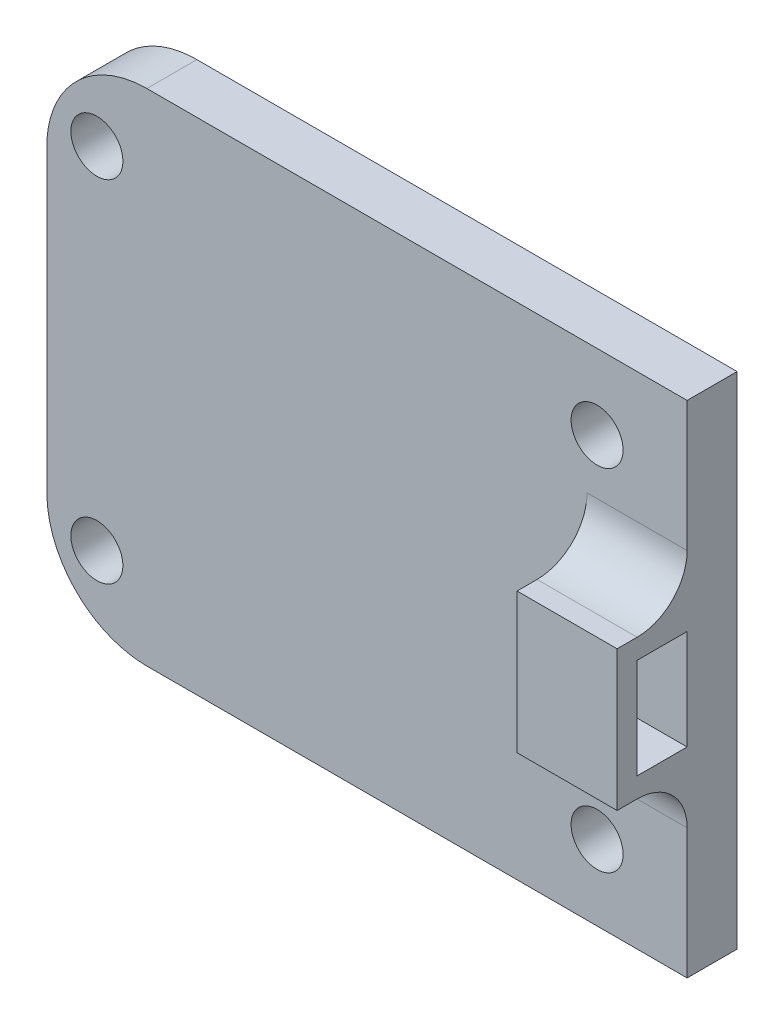
ISO-10303-21;
HEADER;
FILE_DESCRIPTION(('STEP AP214'),'2;1');
FILE_NAME('part.step','',(''),(''),'','','');
FILE_SCHEMA(('AUTOMOTIVE_DESIGN { 1 0 10303 214 1 1 1 1 }'));
ENDSEC;
DATA;
#1=APPLICATION_CONTEXT('core data for automotive mechanical design processes');
#2=APPLICATION_PROTOCOL_DEFINITION('international standard','automotive_design',2000,#1);
#3=PRODUCT_CONTEXT('',#1,'mechanical');
#4=PRODUCT('Part','Part','',(#3));
#5=PRODUCT_RELATED_PRODUCT_CATEGORY('part','',(#4));
#6=PRODUCT_DEFINITION_FORMATION('','',#4);
#7=PRODUCT_DEFINITION_CONTEXT('part definition',#1,'design');
#8=PRODUCT_DEFINITION('design','',#6,#7);
#9=PRODUCT_DEFINITION_SHAPE('','',#8);
#10=(LENGTH_UNIT() NAMED_UNIT(*) SI_UNIT(.MILLI.,.METRE.));
#11=(NAMED_UNIT(*) PLANE_ANGLE_UNIT() SI_UNIT($,.RADIAN.));
#12=(NAMED_UNIT(*) SI_UNIT($,.STERADIAN.) SOLID_ANGLE_UNIT());
#13=UNCERTAINTY_MEASURE_WITH_UNIT(LENGTH_MEASURE(1.E-05),#10,'distance_accuracy_value','');
#14=(GEOMETRIC_REPRESENTATION_CONTEXT(3) GLOBAL_UNCERTAINTY_ASSIGNED_CONTEXT((#13)) GLOBAL_UNIT_ASSIGNED_CONTEXT((#10,
#11,#12)) REPRESENTATION_CONTEXT('',''));
#15=CARTESIAN_POINT('',(0.,0.,0.));
#16=DIRECTION('',(0.,0.,1.));
#17=DIRECTION('',(1.,0.,0.));
#18=AXIS2_PLACEMENT_3D('',#15,#16,#17);
#19=CARTESIAN_POINT('',(0.,0.,5.));
#20=DIRECTION('',(0.,0.,-1.));
#21=DIRECTION('',(-1.,0.,0.));
#22=AXIS2_PLACEMENT_3D('',#19,#20,#21);
#23=PLANE('',#22);
#24=DIRECTION('',(0.,1.,0.));
#25=VECTOR('',#24,1.);
#26=CARTESIAN_POINT('',(54.,30.,5.));
#27=LINE('',#26,#25);
#28=CARTESIAN_POINT('',(54.,30.,5.));
#29=VERTEX_POINT('',#28);
#30=CARTESIAN_POINT('',(54.,37.,5.00000000000001));
#31=VERTEX_POINT('',#30);
#32=EDGE_CURVE('E171',#29,#31,#27,.T.);
#33=ORIENTED_EDGE('',*,*,#32,.T.);
#34=DIRECTION('',(1.,0.,0.));
#35=VECTOR('',#34,1.);
#36=CARTESIAN_POINT('',(0.,37.,5.));
#37=LINE('',#36,#35);
#38=CARTESIAN_POINT('',(64.,37.,5.));
#39=VERTEX_POINT('',#38);
#40=EDGE_CURVE('E457',#31,#39,#37,.T.);
#41=ORIENTED_EDGE('',*,*,#40,.T.);
#42=DIRECTION('',(0.,1.,0.));
#43=VECTOR('',#42,1.);
#44=CARTESIAN_POINT('',(64.,0.,5.));
#45=LINE('',#44,#43);
#46=CARTESIAN_POINT('',(64.,50.,5.));
#47=VERTEX_POINT('',#46);
#48=EDGE_CURVE('E283',#39,#47,#45,.T.);
#49=ORIENTED_EDGE('',*,*,#48,.T.);
#50=DIRECTION('',(-1.,0.,0.));
#51=VECTOR('',#50,1.);
#52=CARTESIAN_POINT('',(0.,50.,5.));
#53=LINE('',#52,#51);
#54=CARTESIAN_POINT('',(10.,50.,5.));
#55=VERTEX_POINT('',#54);
#56=EDGE_CURVE('E288',#47,#55,#53,.T.);
#57=ORIENTED_EDGE('',*,*,#56,.T.);
#58=CARTESIAN_POINT('',(10.,50.,5.));
#59=CARTESIAN_POINT('',(9.71873940862939,50.0000302437821,5.));
#60=CARTESIAN_POINT('',(9.43748316088036,49.9881351412365,5.));
#61=CARTESIAN_POINT('',(8.87698298794853,49.9407126842738,5.));
#62=CARTESIAN_POINT('',(8.59773896688503,49.9051864634849,5.));
#63=CARTESIAN_POINT('',(8.04344901235633,49.8107558621721,5.));
#64=CARTESIAN_POINT('',(7.76840006617864,49.7518691668823,5.));
#65=CARTESIAN_POINT('',(7.22424096829988,49.6111459958114,5.));
#66=CARTESIAN_POINT('',(6.95513074414697,49.529309800179,5.));
#67=CARTESIAN_POINT('',(6.42463096564197,49.3432216940755,5.));
#68=CARTESIAN_POINT('',(6.16324515458578,49.2389591118716,5.));
#69=CARTESIAN_POINT('',(5.65018139195263,49.0087808876758,5.));
#70=CARTESIAN_POINT('',(5.39850364584242,48.8828647877046,5.));
#71=CARTESIAN_POINT('',(4.90669683616817,48.610301372502,5.));
#72=CARTESIAN_POINT('',(4.66656565305335,48.4636578817249,5.));
#73=CARTESIAN_POINT('',(4.19951051282324,48.1506654585722,5.));
#74=CARTESIAN_POINT('',(3.97258648456532,47.9843166323574,5.));
#75=CARTESIAN_POINT('',(3.53355882321716,47.6330965634878,5.));
#76=CARTESIAN_POINT('',(3.32145508500275,47.4482254522391,5.));
#77=CARTESIAN_POINT('',(2.91357387490113,47.0612739280054,5.));
#78=CARTESIAN_POINT('',(2.71779640338468,46.8591935146296,5.));
#79=CARTESIAN_POINT('',(2.34392120071282,46.4392168814837,5.));
#80=CARTESIAN_POINT('',(2.16582707835699,46.2213174490276,5.));
#81=CARTESIAN_POINT('',(1.8286329512801,45.7712923694028,5.));
#82=CARTESIAN_POINT('',(1.66953265427646,45.5391669412312,4.99999999999999));
#83=CARTESIAN_POINT('',(1.37142258831917,45.0622858327539,4.99999999999999));
#84=CARTESIAN_POINT('',(1.23241708546066,44.8175274854213,5.));
#85=CARTESIAN_POINT('',(0.975528047911703,44.3171746784549,5.));
#86=CARTESIAN_POINT('',(0.857644161593804,44.0615803993028,5.00000000000001));
#87=CARTESIAN_POINT('',(0.643882115547591,43.5414762201447,4.99999999999999));
#88=CARTESIAN_POINT('',(0.54799387625296,43.2769704678346,4.99999999999998));
#89=CARTESIAN_POINT('',(0.378859660093142,42.7409265033633,5.00000000000002));
#90=CARTESIAN_POINT('',(0.305608240388747,42.4693899987335,5.00000000000007));
#91=CARTESIAN_POINT('',(0.162897478890375,41.8350735853804,5.00000000000008));
#92=CARTESIAN_POINT('',(0.101812944811614,41.4703549279125,5.00000000000002));
#93=CARTESIAN_POINT('',(0.040732368577235,40.9203488802216,4.99999999999999));
#94=CARTESIAN_POINT('',(0.025463227479286,40.7366189268432,5.));
#95=CARTESIAN_POINT('',(0.00509827072727374,40.368607713583,5.));
#96=CARTESIAN_POINT('',(1.80814562152659E-06,40.1843264895054,5.));
#97=CARTESIAN_POINT('',(0.,40.,4.99999999999998));
#98=B_SPLINE_CURVE_WITH_KNOTS('',3,(#58,#59,#60,#61,#62,#63,#64,#65,#66,#67,#68,#69,#70,#71,#72,
#73,#74,#75,#76,#77,#78,#79,#80,#81,#82,#83,#84,#85,#86,#87,#88,#89,#90,#91,#92,#93,#94,#95,#96,
#97),.UNSPECIFIED.,.F.,.F.,(4,2,2,2,2,2,2,2,2,2,2,2,2,2,2,2,2,2,2,4),(0.,0.843524225534215,
1.68700798857624,2.52985440039549,3.37269052387661,4.2159286068662,5.05918452682157,
5.90228505847176,6.74538104819433,7.58847105701002,8.43156108497183,9.27482281775598,
10.1180715725067,10.9614990856436,11.804912556303,12.6479387548297,13.4907620965667,
14.5975846256286,15.1504384772059,15.7032571691341),.UNSPECIFIED.);
#99=CARTESIAN_POINT('',(0.,40.,5.));
#100=VERTEX_POINT('',#99);
#101=EDGE_CURVE('E396',#55,#100,#98,.T.);
#102=ORIENTED_EDGE('',*,*,#101,.T.);
#103=DIRECTION('',(0.,-1.,0.));
#104=VECTOR('',#103,1.);
#105=CARTESIAN_POINT('',(0.,0.,5.));
#106=LINE('',#105,#104);
#107=CARTESIAN_POINT('',(0.,10.,5.));
#108=VERTEX_POINT('',#107);
#109=EDGE_CURVE('E275',#100,#108,#106,.T.);
#110=ORIENTED_EDGE('',*,*,#109,.T.);
#111=CARTESIAN_POINT('',(0.,10.,5.));
#112=CARTESIAN_POINT('',(-3.02437820508573E-05,9.71873940862939,5.));
#113=CARTESIAN_POINT('',(0.0118648587635351,9.43748316088036,5.));
#114=CARTESIAN_POINT('',(0.0592873157262324,8.87698298794852,5.));
#115=CARTESIAN_POINT('',(0.0948135365150906,8.59773896688503,5.));
#116=CARTESIAN_POINT('',(0.189244137827918,8.04344901235632,5.));
#117=CARTESIAN_POINT('',(0.248130833117677,7.76840006617864,5.));
#118=CARTESIAN_POINT('',(0.388854004188663,7.22424096829988,5.));
#119=CARTESIAN_POINT('',(0.470690199820989,6.95513074414697,5.));
#120=CARTESIAN_POINT('',(0.656778305924568,6.42463096564197,5.));
#121=CARTESIAN_POINT('',(0.76104088812843,6.16324515458577,5.));
#122=CARTESIAN_POINT('',(0.991219112324222,5.65018139195262,5.));
#123=CARTESIAN_POINT('',(1.11713521229541,5.39850364584242,5.));
#124=CARTESIAN_POINT('',(1.38969862749806,4.90669683616817,5.));
#125=CARTESIAN_POINT('',(1.53634211827508,4.66656565305335,5.));
#126=CARTESIAN_POINT('',(1.8493345414278,4.19951051282324,5.));
#127=CARTESIAN_POINT('',(2.01568336764263,3.97258648456532,5.00000000000001));
#128=CARTESIAN_POINT('',(2.36690343651221,3.53355882321717,5.00000000000001));
#129=CARTESIAN_POINT('',(2.55177454776092,3.32145508500274,5.));
#130=CARTESIAN_POINT('',(2.93872607199461,2.91357387490112,5.));
#131=CARTESIAN_POINT('',(3.14080648537042,2.71779640338468,5.));
#132=CARTESIAN_POINT('',(3.5607831185163,2.34392120071282,5.));
#133=CARTESIAN_POINT('',(3.77868255097239,2.16582707835699,5.));
#134=CARTESIAN_POINT('',(4.22870763059718,1.8286329512801,5.));
#135=CARTESIAN_POINT('',(4.46083305876885,1.66953265427646,5.));
#136=CARTESIAN_POINT('',(4.93771416724614,1.37142258831917,5.));
#137=CARTESIAN_POINT('',(5.18247251457876,1.23241708546066,5.));
#138=CARTESIAN_POINT('',(5.68282532154507,0.975528047911706,5.));
#139=CARTESIAN_POINT('',(5.93841960069723,0.857644161593809,5.));
#140=CARTESIAN_POINT('',(6.4585237798553,0.643882115547596,5.));
#141=CARTESIAN_POINT('',(6.72302953216546,0.547993876252964,5.));
#142=CARTESIAN_POINT('',(7.25907349663673,0.378859660093146,5.));
#143=CARTESIAN_POINT('',(7.53061000126654,0.30560824038875,5.));
#144=CARTESIAN_POINT('',(8.16492641461962,0.162897478890377,5.));
#145=CARTESIAN_POINT('',(8.5296450720875,0.101812944811615,5.));
#146=CARTESIAN_POINT('',(9.07965111977843,0.0407323685772355,5.));
#147=CARTESIAN_POINT('',(9.26338107315682,0.0254632274792861,5.));
#148=CARTESIAN_POINT('',(9.63139228641706,0.00509827072727316,5.));
#149=CARTESIAN_POINT('',(9.81567351049458,1.8081456208478E-06,5.));
#150=CARTESIAN_POINT('',(10.,0.,5.));
#151=B_SPLINE_CURVE_WITH_KNOTS('',3,(#111,#112,#113,#114,#115,#116,#117,#118,#119,#120,#121,
#122,#123,#124,#125,#126,#127,#128,#129,#130,#131,#132,#133,#134,#135,#136,#137,#138,#139,#140,
#141,#142,#143,#144,#145,#146,#147,#148,#149,#150),.UNSPECIFIED.,.F.,.F.,(4,2,2,2,2,2,2,2,2,2,2,
2,2,2,2,2,2,2,2,4),(0.,0.843524225534219,1.68700798857625,2.52985440039549,3.37269052387661,
4.2159286068662,5.05918452682158,5.90228505847177,6.74538104819434,7.58847105701003,
8.43156108497184,9.27482281775598,10.1180715725067,10.9614990856436,11.804912556303,
12.6479387548297,13.4907620965666,14.5975846256286,15.1504384772059,15.7032571691341),.UNSPECIFIED.);
#152=CARTESIAN_POINT('',(10.,0.,5.));
#153=VERTEX_POINT('',#152);
#154=EDGE_CURVE('E376',#108,#153,#151,.T.);
#155=ORIENTED_EDGE('',*,*,#154,.T.);
#156=DIRECTION('',(1.,0.,0.));
#157=VECTOR('',#156,1.);
#158=CARTESIAN_POINT('',(0.,0.,5.));
#159=LINE('',#158,#157);
#160=CARTESIAN_POINT('',(64.,0.,5.));
#161=VERTEX_POINT('',#160);
#162=EDGE_CURVE('E279',#153,#161,#159,.T.);
#163=ORIENTED_EDGE('',*,*,#162,.T.);
#164=CARTESIAN_POINT('',(64.,13.,5.));
#165=VERTEX_POINT('',#164);
#166=EDGE_CURVE('E284',#161,#165,#45,.T.);
#167=ORIENTED_EDGE('',*,*,#166,.T.);
#168=DIRECTION('',(1.,0.,0.));
#169=VECTOR('',#168,1.);
#170=CARTESIAN_POINT('',(0.,13.,5.));
#171=LINE('',#170,#169);
#172=CARTESIAN_POINT('',(54.,13.,5.));
#173=VERTEX_POINT('',#172);
#174=EDGE_CURVE('E472',#165,#173,#171,.F.);
#175=ORIENTED_EDGE('',*,*,#174,.T.);
#176=DIRECTION('',(0.,1.,0.));
#177=VECTOR('',#176,1.);
#178=CARTESIAN_POINT('',(54.,18.,5.));
#179=LINE('',#178,#177);
#180=CARTESIAN_POINT('',(54.,20.,5.));
#181=VERTEX_POINT('',#180);
#182=EDGE_CURVE('E188',#173,#181,#179,.T.);
#183=ORIENTED_EDGE('',*,*,#182,.T.);
#184=DIRECTION('',(1.,0.,0.));
#185=VECTOR('',#184,1.);
#186=CARTESIAN_POINT('',(54.,20.,5.));
#187=LINE('',#186,#185);
#188=CARTESIAN_POINT('',(64.,20.,5.));
#189=VERTEX_POINT('',#188);
#190=EDGE_CURVE('E237',#181,#189,#187,.T.);
#191=ORIENTED_EDGE('',*,*,#190,.T.);
#192=CARTESIAN_POINT('',(64.,30.,5.));
#193=VERTEX_POINT('',#192);
#194=EDGE_CURVE('E289',#189,#193,#45,.T.);
#195=ORIENTED_EDGE('',*,*,#194,.T.);
#196=DIRECTION('',(1.,0.,0.));
#197=VECTOR('',#196,1.);
#198=CARTESIAN_POINT('',(54.,30.,5.));
#199=LINE('',#198,#197);
#200=EDGE_CURVE('E226',#29,#193,#199,.T.);
#201=ORIENTED_EDGE('',*,*,#200,.F.);
#202=EDGE_LOOP('',(#33,#41,#49,#57,#102,#110,#155,#163,#167,#175,#183,#191,#195,#201));
#203=FACE_BOUND('',#202,.T.);
#204=CARTESIAN_POINT('',(5.,42.5,5.));
#205=DIRECTION('',(0.,0.,1.));
#206=DIRECTION('',(1.,0.,0.));
#207=AXIS2_PLACEMENT_3D('',#204,#205,#206);
#208=CIRCLE('',#207,2.6);
#209=CARTESIAN_POINT('',(7.6,42.5,5.));
#210=VERTEX_POINT('',#209);
#211=EDGE_CURVE('E267',#210,#210,#208,.T.);
#212=ORIENTED_EDGE('',*,*,#211,.F.);
#213=EDGE_LOOP('',(#212));
#214=FACE_BOUND('',#213,.T.);
#215=CARTESIAN_POINT('',(55.,42.5,5.));
#216=DIRECTION('',(0.,0.,1.));
#217=DIRECTION('',(1.,0.,0.));
#218=AXIS2_PLACEMENT_3D('',#215,#216,#217);
#219=CIRCLE('',#218,2.6);
#220=CARTESIAN_POINT('',(57.6,42.5,5.));
#221=VERTEX_POINT('',#220);
#222=EDGE_CURVE('E259',#221,#221,#219,.T.);
#223=ORIENTED_EDGE('',*,*,#222,.F.);
#224=EDGE_LOOP('',(#223));
#225=FACE_BOUND('',#224,.T.);
#226=CARTESIAN_POINT('',(55.0000000000004,7.5,5.));
#227=DIRECTION('',(0.,0.,1.));
#228=DIRECTION('',(1.,0.,0.));
#229=AXIS2_PLACEMENT_3D('',#226,#227,#228);
#230=CIRCLE('',#229,2.6);
#231=CARTESIAN_POINT('',(57.6000000000004,7.5,5.));
#232=VERTEX_POINT('',#231);
#233=EDGE_CURVE('E251',#232,#232,#230,.T.);
#234=ORIENTED_EDGE('',*,*,#233,.F.);
#235=EDGE_LOOP('',(#234));
#236=FACE_BOUND('',#235,.T.);
#237=CARTESIAN_POINT('',(5.00000000000036,7.5,5.));
#238=DIRECTION('',(0.,0.,1.));
#239=DIRECTION('',(1.,0.,0.));
#240=AXIS2_PLACEMENT_3D('',#237,#238,#239);
#241=CIRCLE('',#240,2.6);
#242=CARTESIAN_POINT('',(7.60000000000036,7.5,5.));
#243=VERTEX_POINT('',#242);
#244=EDGE_CURVE('E243',#243,#243,#241,.T.);
#245=ORIENTED_EDGE('',*,*,#244,.F.);
#246=EDGE_LOOP('',(#245));
#247=FACE_BOUND('',#246,.T.);
#248=ADVANCED_FACE('F45',(#203,#214,#225,#236,#247),#23,.F.);
#249=CARTESIAN_POINT('',(0.,0.,0.));
#250=DIRECTION('',(0.,0.,-1.));
#251=DIRECTION('',(-1.,0.,0.));
#252=AXIS2_PLACEMENT_3D('',#249,#250,#251);
#253=PLANE('',#252);
#254=CARTESIAN_POINT('',(55.0000000000004,7.5,0.));
#255=DIRECTION('',(0.,0.,1.));
#256=DIRECTION('',(1.,0.,0.));
#257=AXIS2_PLACEMENT_3D('',#254,#255,#256);
#258=CIRCLE('',#257,2.6);
#259=CARTESIAN_POINT('',(57.6000000000004,7.5,0.));
#260=VERTEX_POINT('',#259);
#261=EDGE_CURVE('E247',#260,#260,#258,.T.);
#262=ORIENTED_EDGE('',*,*,#261,.T.);
#263=EDGE_LOOP('',(#262));
#264=FACE_BOUND('',#263,.T.);
#265=CARTESIAN_POINT('',(5.,42.5,0.));
#266=DIRECTION('',(0.,0.,1.));
#267=DIRECTION('',(1.,0.,0.));
#268=AXIS2_PLACEMENT_3D('',#265,#266,#267);
#269=CIRCLE('',#268,2.6);
#270=CARTESIAN_POINT('',(7.6,42.5,0.));
#271=VERTEX_POINT('',#270);
#272=EDGE_CURVE('E263',#271,#271,#269,.T.);
#273=ORIENTED_EDGE('',*,*,#272,.T.);
#274=EDGE_LOOP('',(#273));
#275=FACE_BOUND('',#274,.T.);
#276=DIRECTION('',(0.,-1.,0.));
#277=VECTOR('',#276,1.);
#278=CARTESIAN_POINT('',(0.,0.,0.));
#279=LINE('',#278,#277);
#280=CARTESIAN_POINT('',(0.,40.,0.));
#281=VERTEX_POINT('',#280);
#282=CARTESIAN_POINT('',(0.,10.,0.));
#283=VERTEX_POINT('',#282);
#284=EDGE_CURVE('E271',#281,#283,#279,.T.);
#285=ORIENTED_EDGE('',*,*,#284,.F.);
#286=CARTESIAN_POINT('',(0.,40.,0.));
#287=CARTESIAN_POINT('',(-3.02437820511849E-05,40.2812605913706,0.));
#288=CARTESIAN_POINT('',(0.011864858763535,40.5625168391197,0.));
#289=CARTESIAN_POINT('',(0.0592873157262323,41.1230170120515,0.));
#290=CARTESIAN_POINT('',(0.0948135365150903,41.402261033115,0.));
#291=CARTESIAN_POINT('',(0.189244137827916,41.9565509876437,0.));
#292=CARTESIAN_POINT('',(0.248130833117673,42.2315999338214,0.));
#293=CARTESIAN_POINT('',(0.388854004188659,42.7757590317001,0.));
#294=CARTESIAN_POINT('',(0.470690199820987,43.044869255853,0.));
#295=CARTESIAN_POINT('',(0.656778305924568,43.575369034358,0.));
#296=CARTESIAN_POINT('',(0.761040888128432,43.8367548454142,0.));
#297=CARTESIAN_POINT('',(0.991219112324221,44.3498186080474,0.));
#298=CARTESIAN_POINT('',(1.1171352122954,44.6014963541576,0.));
#299=CARTESIAN_POINT('',(1.38969862749805,45.0933031638318,0.));
#300=CARTESIAN_POINT('',(1.53634211827508,45.3334343469467,0.));
#301=CARTESIAN_POINT('',(1.8493345414278,45.8004894871768,0.));
#302=CARTESIAN_POINT('',(2.01568336764263,46.0274135154347,0.));
#303=CARTESIAN_POINT('',(2.3669034365122,46.4664411767828,0.));
#304=CARTESIAN_POINT('',(2.55177454776091,46.6785449149973,0.));
#305=CARTESIAN_POINT('',(2.9387260719946,47.0864261250989,0.));
#306=CARTESIAN_POINT('',(3.14080648537041,47.2822035966153,0.));
#307=CARTESIAN_POINT('',(3.56078311851629,47.6560787992872,0.));
#308=CARTESIAN_POINT('',(3.77868255097239,47.834172921643,0.));
#309=CARTESIAN_POINT('',(4.22870763059718,48.1713670487199,0.));
#310=CARTESIAN_POINT('',(4.46083305876884,48.3304673457236,0.));
#311=CARTESIAN_POINT('',(4.93771416724614,48.6285774116808,0.));
#312=CARTESIAN_POINT('',(5.18247251457876,48.7675829145394,0.));
#313=CARTESIAN_POINT('',(5.68282532154507,49.0244719520883,0.));
#314=CARTESIAN_POINT('',(5.93841960069722,49.1423558384062,0.));
#315=CARTESIAN_POINT('',(6.45852377985529,49.3561178844524,0.));
#316=CARTESIAN_POINT('',(6.72302953216546,49.4520061237471,0.));
#317=CARTESIAN_POINT('',(7.25907349663673,49.6211403399069,0.));
#318=CARTESIAN_POINT('',(7.53061000126654,49.6943917596113,0.));
#319=CARTESIAN_POINT('',(8.16492641461962,49.8371025211096,0.));
#320=CARTESIAN_POINT('',(8.5296450720875,49.8981870551884,0.));
#321=CARTESIAN_POINT('',(9.07965111977843,49.9592676314228,0.));
#322=CARTESIAN_POINT('',(9.26338107315682,49.9745367725207,0.));
#323=CARTESIAN_POINT('',(9.63139228641706,49.9949017292727,0.));
#324=CARTESIAN_POINT('',(9.81567351049458,49.9999981918544,0.));
#325=CARTESIAN_POINT('',(10.,50.,0.));
#326=B_SPLINE_CURVE_WITH_KNOTS('',3,(#286,#287,#288,#289,#290,#291,#292,#293,#294,#295,#296,
#297,#298,#299,#300,#301,#302,#303,#304,#305,#306,#307,#308,#309,#310,#311,#312,#313,#314,#315,
#316,#317,#318,#319,#320,#321,#322,#323,#324,#325),.UNSPECIFIED.,.F.,.F.,(4,2,2,2,2,2,2,2,2,2,2,
2,2,2,2,2,2,2,2,4),(0.,0.843524225534214,1.68700798857624,2.52985440039549,3.37269052387661,
4.21592860686619,5.05918452682157,5.90228505847176,6.74538104819433,7.58847105701002,
8.43156108497182,9.27482281775597,10.1180715725067,10.9614990856436,11.804912556303,
12.6479387548297,13.4907620965666,14.5975846256286,15.1504384772058,15.7032571691341),.UNSPECIFIED.);
#327=CARTESIAN_POINT('',(10.,50.,0.));
#328=VERTEX_POINT('',#327);
#329=EDGE_CURVE('E338',#281,#328,#326,.T.);
#330=ORIENTED_EDGE('',*,*,#329,.T.);
#331=DIRECTION('',(-1.,0.,0.));
#332=VECTOR('',#331,1.);
#333=CARTESIAN_POINT('',(0.,50.,0.));
#334=LINE('',#333,#332);
#335=CARTESIAN_POINT('',(64.,50.,0.));
#336=VERTEX_POINT('',#335);
#337=EDGE_CURVE('E280',#336,#328,#334,.T.);
#338=ORIENTED_EDGE('',*,*,#337,.F.);
#339=DIRECTION('',(0.,1.,0.));
#340=VECTOR('',#339,1.);
#341=CARTESIAN_POINT('',(64.,0.,0.));
#342=LINE('',#341,#340);
#343=CARTESIAN_POINT('',(64.,0.,0.));
#344=VERTEX_POINT('',#343);
#345=EDGE_CURVE('E300',#344,#336,#342,.T.);
#346=ORIENTED_EDGE('',*,*,#345,.F.);
#347=DIRECTION('',(1.,0.,0.));
#348=VECTOR('',#347,1.);
#349=CARTESIAN_POINT('',(0.,0.,0.));
#350=LINE('',#349,#348);
#351=CARTESIAN_POINT('',(10.,0.,0.));
#352=VERTEX_POINT('',#351);
#353=EDGE_CURVE('E297',#352,#344,#350,.T.);
#354=ORIENTED_EDGE('',*,*,#353,.F.);
#355=CARTESIAN_POINT('',(10.,0.,0.));
#356=CARTESIAN_POINT('',(9.71873940862939,-3.02437820508262E-05,0.));
#357=CARTESIAN_POINT('',(9.43748316088036,0.0118648587635351,0.));
#358=CARTESIAN_POINT('',(8.87698298794852,0.0592873157262323,0.));
#359=CARTESIAN_POINT('',(8.59773896688503,0.0948135365150903,0.));
#360=CARTESIAN_POINT('',(8.04344901235632,0.189244137827918,0.));
#361=CARTESIAN_POINT('',(7.76840006617864,0.248130833117677,0.));
#362=CARTESIAN_POINT('',(7.22424096829989,0.388854004188663,0.));
#363=CARTESIAN_POINT('',(6.95513074414697,0.470690199820988,0.));
#364=CARTESIAN_POINT('',(6.42463096564197,0.656778305924566,0.));
#365=CARTESIAN_POINT('',(6.16324515458577,0.761040888128429,0.));
#366=CARTESIAN_POINT('',(5.65018139195263,0.991219112324221,0.));
#367=CARTESIAN_POINT('',(5.39850364584242,1.1171352122954,0.));
#368=CARTESIAN_POINT('',(4.90669683616818,1.38969862749805,0.));
#369=CARTESIAN_POINT('',(4.66656565305335,1.53634211827508,0.));
#370=CARTESIAN_POINT('',(4.19951051282324,1.8493345414278,0.));
#371=CARTESIAN_POINT('',(3.97258648456532,2.01568336764263,0.));
#372=CARTESIAN_POINT('',(3.53355882321717,2.36690343651221,0.));
#373=CARTESIAN_POINT('',(3.32145508500275,2.55177454776091,0.));
#374=CARTESIAN_POINT('',(2.91357387490112,2.93872607199461,0.));
#375=CARTESIAN_POINT('',(2.71779640338468,3.14080648537041,0.));
#376=CARTESIAN_POINT('',(2.34392120071282,3.56078311851629,0.));
#377=CARTESIAN_POINT('',(2.165827078357,3.77868255097239,0.));
#378=CARTESIAN_POINT('',(1.82863295128011,4.22870763059718,0.));
#379=CARTESIAN_POINT('',(1.66953265427646,4.46083305876884,0.));
#380=CARTESIAN_POINT('',(1.37142258831917,4.93771416724613,0.));
#381=CARTESIAN_POINT('',(1.23241708546067,5.18247251457876,0.));
#382=CARTESIAN_POINT('',(0.975528047911709,5.68282532154506,0.));
#383=CARTESIAN_POINT('',(0.857644161593811,5.93841960069722,0.));
#384=CARTESIAN_POINT('',(0.643882115547598,6.45852377985529,0.));
#385=CARTESIAN_POINT('',(0.547993876252966,6.72302953216546,0.));
#386=CARTESIAN_POINT('',(0.378859660093147,7.25907349663673,0.));
#387=CARTESIAN_POINT('',(0.305608240388751,7.53061000126653,0.));
#388=CARTESIAN_POINT('',(0.162897478890378,8.16492641461961,0.));
#389=CARTESIAN_POINT('',(0.101812944811616,8.52964507208749,0.));
#390=CARTESIAN_POINT('',(0.040732368577236,9.07965111977843,0.));
#391=CARTESIAN_POINT('',(0.0254632274792864,9.26338107315682,0.));
#392=CARTESIAN_POINT('',(0.00509827072727319,9.63139228641706,0.));
#393=CARTESIAN_POINT('',(1.80814562080788E-06,9.81567351049458,0.));
#394=CARTESIAN_POINT('',(0.,10.,0.));
#395=B_SPLINE_CURVE_WITH_KNOTS('',3,(#355,#356,#357,#358,#359,#360,#361,#362,#363,#364,#365,
#366,#367,#368,#369,#370,#371,#372,#373,#374,#375,#376,#377,#378,#379,#380,#381,#382,#383,#384,
#385,#386,#387,#388,#389,#390,#391,#392,#393,#394),.UNSPECIFIED.,.F.,.F.,(4,2,2,2,2,2,2,2,2,2,2,
2,2,2,2,2,2,2,2,4),(0.,0.843524225534221,1.68700798857624,2.52985440039549,3.37269052387661,
4.2159286068662,5.05918452682157,5.90228505847176,6.74538104819434,7.58847105701002,
8.43156108497183,9.27482281775598,10.1180715725067,10.9614990856436,11.804912556303,
12.6479387548297,13.4907620965666,14.5975846256286,15.1504384772058,15.7032571691341),.UNSPECIFIED.);
#396=EDGE_CURVE('E327',#352,#283,#395,.T.);
#397=ORIENTED_EDGE('',*,*,#396,.T.);
#398=EDGE_LOOP('',(#285,#330,#338,#346,#354,#397));
#399=FACE_BOUND('',#398,.T.);
#400=CARTESIAN_POINT('',(55.,42.5,0.));
#401=DIRECTION('',(0.,0.,1.));
#402=DIRECTION('',(1.,0.,0.));
#403=AXIS2_PLACEMENT_3D('',#400,#401,#402);
#404=CIRCLE('',#403,2.6);
#405=CARTESIAN_POINT('',(57.6,42.5,0.));
#406=VERTEX_POINT('',#405);
#407=EDGE_CURVE('E255',#406,#406,#404,.T.);
#408=ORIENTED_EDGE('',*,*,#407,.T.);
#409=EDGE_LOOP('',(#408));
#410=FACE_BOUND('',#409,.T.);
#411=CARTESIAN_POINT('',(5.00000000000036,7.5,0.));
#412=DIRECTION('',(0.,0.,1.));
#413=DIRECTION('',(1.,0.,0.));
#414=AXIS2_PLACEMENT_3D('',#411,#412,#413);
#415=CIRCLE('',#414,2.6);
#416=CARTESIAN_POINT('',(7.60000000000036,7.5,0.));
#417=VERTEX_POINT('',#416);
#418=EDGE_CURVE('E230',#417,#417,#415,.T.);
#419=ORIENTED_EDGE('',*,*,#418,.T.);
#420=EDGE_LOOP('',(#419));
#421=FACE_BOUND('',#420,.T.);
#422=ADVANCED_FACE('F345',(#264,#275,#399,#410,#421),#253,.T.);
#423=CARTESIAN_POINT('',(0.,0.,5.));
#424=DIRECTION('',(1.,0.,0.));
#425=DIRECTION('',(0.,0.,-1.));
#426=AXIS2_PLACEMENT_3D('',#423,#424,#425);
#427=PLANE('',#426);
#428=ORIENTED_EDGE('',*,*,#109,.F.);
#429=CARTESIAN_POINT('',(0.,40.,15.));
#430=CARTESIAN_POINT('',(0.,40.,11.6666666666666));
#431=CARTESIAN_POINT('',(0.,40.,8.33333333333332));
#432=CARTESIAN_POINT('',(0.,40.,4.99999999999998));
#433=CARTESIAN_POINT('',(0.,40.,3.33333333333332));
#434=CARTESIAN_POINT('',(0.,40.,1.66666666666665));
#435=CARTESIAN_POINT('',(0.,40.,0.));
#436=CARTESIAN_POINT('',(0.,40.,-3.33333333333335));
#437=CARTESIAN_POINT('',(0.,40.,-6.66666666666669));
#438=CARTESIAN_POINT('',(0.,40.,-10.));
#439=(BOUNDED_CURVE() B_SPLINE_CURVE(3,(#429,#430,#431,#432,#433,#434,#435,#436,#437,#438),
.UNSPECIFIED.,.F.,.F.) B_SPLINE_CURVE_WITH_KNOTS((4,3,3,4),(-0.01,0.,0.005,0.015),
.UNSPECIFIED.) CURVE() GEOMETRIC_REPRESENTATION_ITEM() RATIONAL_B_SPLINE_CURVE((1.,1.,1.,1.,1.,
1.,1.,1.,1.,1.)) REPRESENTATION_ITEM(''));
#440=EDGE_CURVE('E318',#100,#281,#439,.T.);
#441=ORIENTED_EDGE('',*,*,#440,.T.);
#442=ORIENTED_EDGE('',*,*,#284,.T.);
#443=CARTESIAN_POINT('',(0.,10.,15.));
#444=CARTESIAN_POINT('',(0.,10.,11.6666666666667));
#445=CARTESIAN_POINT('',(0.,10.,8.33333333333334));
#446=CARTESIAN_POINT('',(0.,10.,5.));
#447=CARTESIAN_POINT('',(0.,10.,3.33333333333334));
#448=CARTESIAN_POINT('',(0.,10.,1.66666666666667));
#449=CARTESIAN_POINT('',(0.,10.,0.));
#450=CARTESIAN_POINT('',(0.,10.,-3.33333333333333));
#451=CARTESIAN_POINT('',(0.,10.,-6.66666666666666));
#452=CARTESIAN_POINT('',(0.,10.,-10.));
#453=(BOUNDED_CURVE() B_SPLINE_CURVE(3,(#443,#444,#445,#446,#447,#448,#449,#450,#451,#452),
.UNSPECIFIED.,.F.,.F.) B_SPLINE_CURVE_WITH_KNOTS((4,3,3,4),(-0.01,0.,0.005,0.015),
.UNSPECIFIED.) CURVE() GEOMETRIC_REPRESENTATION_ITEM() RATIONAL_B_SPLINE_CURVE((1.,1.,1.,1.,1.,
1.,1.,1.,1.,1.)) REPRESENTATION_ITEM(''));
#454=EDGE_CURVE('E313',#283,#108,#453,.F.);
#455=ORIENTED_EDGE('',*,*,#454,.T.);
#456=EDGE_LOOP('',(#428,#441,#442,#455));
#457=FACE_BOUND('',#456,.T.);
#458=ADVANCED_FACE('F497',(#457),#427,.F.);
#459=CARTESIAN_POINT('',(0.,0.,5.));
#460=DIRECTION('',(0.,1.,0.));
#461=DIRECTION('',(0.,0.,1.));
#462=AXIS2_PLACEMENT_3D('',#459,#460,#461);
#463=PLANE('',#462);
#464=ORIENTED_EDGE('',*,*,#162,.F.);
#465=CARTESIAN_POINT('',(10.,0.,15.));
#466=CARTESIAN_POINT('',(10.,0.,11.6666666666667));
#467=CARTESIAN_POINT('',(10.,0.,8.33333333333334));
#468=CARTESIAN_POINT('',(10.,0.,5.));
#469=CARTESIAN_POINT('',(10.,0.,3.33333333333334));
#470=CARTESIAN_POINT('',(10.,0.,1.66666666666667));
#471=CARTESIAN_POINT('',(10.,0.,0.));
#472=CARTESIAN_POINT('',(10.,0.,-3.33333333333333));
#473=CARTESIAN_POINT('',(10.,0.,-6.66666666666666));
#474=CARTESIAN_POINT('',(10.,0.,-10.));
#475=(BOUNDED_CURVE() B_SPLINE_CURVE(3,(#465,#466,#467,#468,#469,#470,#471,#472,#473,#474),
.UNSPECIFIED.,.F.,.F.) B_SPLINE_CURVE_WITH_KNOTS((4,3,3,4),(-0.01,0.,0.005,0.015),
.UNSPECIFIED.) CURVE() GEOMETRIC_REPRESENTATION_ITEM() RATIONAL_B_SPLINE_CURVE((1.,1.,1.,1.,1.,
1.,1.,1.,1.,1.)) REPRESENTATION_ITEM(''));
#476=EDGE_CURVE('E475',#153,#352,#475,.T.);
#477=ORIENTED_EDGE('',*,*,#476,.T.);
#478=ORIENTED_EDGE('',*,*,#353,.T.);
#479=DIRECTION('',(0.,0.,-1.));
#480=VECTOR('',#479,1.);
#481=CARTESIAN_POINT('',(64.,0.,5.));
#482=LINE('',#481,#480);
#483=EDGE_CURVE('E309',#161,#344,#482,.T.);
#484=ORIENTED_EDGE('',*,*,#483,.F.);
#485=EDGE_LOOP('',(#464,#477,#478,#484));
#486=FACE_BOUND('',#485,.T.);
#487=ADVANCED_FACE('F514',(#486),#463,.F.);
#488=CARTESIAN_POINT('',(64.,0.,5.));
#489=DIRECTION('',(-1.,0.,0.));
#490=DIRECTION('',(0.,0.,1.));
#491=AXIS2_PLACEMENT_3D('',#488,#489,#490);
#492=PLANE('',#491);
#493=ORIENTED_EDGE('',*,*,#48,.F.);
#494=CARTESIAN_POINT('',(64.,37.,10.));
#495=DIRECTION('',(-1.,0.,0.));
#496=DIRECTION('',(0.,0.,1.));
#497=AXIS2_PLACEMENT_3D('',#494,#495,#496);
#498=CIRCLE('',#497,5.);
#499=CARTESIAN_POINT('',(64.,32.,10.));
#500=VERTEX_POINT('',#499);
#501=EDGE_CURVE('E459',#39,#500,#498,.T.);
#502=ORIENTED_EDGE('',*,*,#501,.T.);
#503=DIRECTION('',(0.,0.,1.));
#504=VECTOR('',#503,1.);
#505=CARTESIAN_POINT('',(64.,32.,5.));
#506=LINE('',#505,#504);
#507=CARTESIAN_POINT('',(64.,32.,12.));
#508=VERTEX_POINT('',#507);
#509=EDGE_CURVE('E205',#500,#508,#506,.T.);
#510=ORIENTED_EDGE('',*,*,#509,.T.);
#511=DIRECTION('',(0.,-1.,0.));
#512=VECTOR('',#511,1.);
#513=CARTESIAN_POINT('',(64.,32.,12.));
#514=LINE('',#513,#512);
#515=CARTESIAN_POINT('',(64.,18.,12.));
#516=VERTEX_POINT('',#515);
#517=EDGE_CURVE('E177',#508,#516,#514,.T.);
#518=ORIENTED_EDGE('',*,*,#517,.T.);
#519=DIRECTION('',(0.,0.,-1.));
#520=VECTOR('',#519,1.);
#521=CARTESIAN_POINT('',(64.,18.,5.));
#522=LINE('',#521,#520);
#523=CARTESIAN_POINT('',(64.,18.,10.));
#524=VERTEX_POINT('',#523);
#525=EDGE_CURVE('E210',#516,#524,#522,.T.);
#526=ORIENTED_EDGE('',*,*,#525,.T.);
#527=CARTESIAN_POINT('',(64.,13.,10.));
#528=DIRECTION('',(-1.,0.,0.));
#529=DIRECTION('',(0.,0.,1.));
#530=AXIS2_PLACEMENT_3D('',#527,#528,#529);
#531=CIRCLE('',#530,5.);
#532=EDGE_CURVE('E54',#524,#165,#531,.T.);
#533=ORIENTED_EDGE('',*,*,#532,.T.);
#534=ORIENTED_EDGE('',*,*,#166,.F.);
#535=ORIENTED_EDGE('',*,*,#483,.T.);
#536=ORIENTED_EDGE('',*,*,#345,.T.);
#537=DIRECTION('',(0.,0.,-1.));
#538=VECTOR('',#537,1.);
#539=CARTESIAN_POINT('',(64.,50.,5.));
#540=LINE('',#539,#538);
#541=EDGE_CURVE('E293',#47,#336,#540,.T.);
#542=ORIENTED_EDGE('',*,*,#541,.F.);
#543=EDGE_LOOP('',(#493,#502,#510,#518,#526,#533,#534,#535,#536,#542));
#544=FACE_BOUND('',#543,.T.);
#545=DIRECTION('',(0.,0.,-1.));
#546=VECTOR('',#545,1.);
#547=CARTESIAN_POINT('',(64.,30.,5.));
#548=LINE('',#547,#546);
#549=CARTESIAN_POINT('',(64.,30.,10.));
#550=VERTEX_POINT('',#549);
#551=EDGE_CURVE('E222',#550,#193,#548,.T.);
#552=ORIENTED_EDGE('',*,*,#551,.T.);
#553=ORIENTED_EDGE('',*,*,#194,.F.);
#554=DIRECTION('',(0.,0.,1.));
#555=VECTOR('',#554,1.);
#556=CARTESIAN_POINT('',(64.,20.,5.));
#557=LINE('',#556,#555);
#558=CARTESIAN_POINT('',(64.,20.,10.));
#559=VERTEX_POINT('',#558);
#560=EDGE_CURVE('E214',#189,#559,#557,.T.);
#561=ORIENTED_EDGE('',*,*,#560,.T.);
#562=DIRECTION('',(0.,1.,0.));
#563=VECTOR('',#562,1.);
#564=CARTESIAN_POINT('',(64.,30.,10.));
#565=LINE('',#564,#563);
#566=EDGE_CURVE('E218',#559,#550,#565,.T.);
#567=ORIENTED_EDGE('',*,*,#566,.T.);
#568=EDGE_LOOP('',(#552,#553,#561,#567));
#569=FACE_BOUND('',#568,.T.);
#570=ADVANCED_FACE('F510',(#544,#569),#492,.F.);
#571=CARTESIAN_POINT('',(0.,50.,5.));
#572=DIRECTION('',(0.,-1.,0.));
#573=DIRECTION('',(0.,0.,-1.));
#574=AXIS2_PLACEMENT_3D('',#571,#572,#573);
#575=PLANE('',#574);
#576=ORIENTED_EDGE('',*,*,#337,.T.);
#577=CARTESIAN_POINT('',(10.,50.,15.));
#578=CARTESIAN_POINT('',(10.,50.,11.6666666666667));
#579=CARTESIAN_POINT('',(10.,50.,8.33333333333334));
#580=CARTESIAN_POINT('',(10.,50.,5.));
#581=CARTESIAN_POINT('',(10.,50.,3.33333333333334));
#582=CARTESIAN_POINT('',(10.,50.,1.66666666666667));
#583=CARTESIAN_POINT('',(10.,50.,0.));
#584=CARTESIAN_POINT('',(10.,50.,-3.33333333333333));
#585=CARTESIAN_POINT('',(10.,50.,-6.66666666666666));
#586=CARTESIAN_POINT('',(10.,50.,-10.));
#587=(BOUNDED_CURVE() B_SPLINE_CURVE(3,(#577,#578,#579,#580,#581,#582,#583,#584,#585,#586),
.UNSPECIFIED.,.F.,.F.) B_SPLINE_CURVE_WITH_KNOTS((4,3,3,4),(-0.01,0.,0.005,0.015),
.UNSPECIFIED.) CURVE() GEOMETRIC_REPRESENTATION_ITEM() RATIONAL_B_SPLINE_CURVE((1.,1.,1.,1.,1.,
1.,1.,1.,1.,1.)) REPRESENTATION_ITEM(''));
#588=EDGE_CURVE('E397',#328,#55,#587,.F.);
#589=ORIENTED_EDGE('',*,*,#588,.T.);
#590=ORIENTED_EDGE('',*,*,#56,.F.);
#591=ORIENTED_EDGE('',*,*,#541,.T.);
#592=EDGE_LOOP('',(#576,#589,#590,#591));
#593=FACE_BOUND('',#592,.T.);
#594=ADVANCED_FACE('F414',(#593),#575,.F.);
#595=CARTESIAN_POINT('',(5.,42.5,5.));
#596=DIRECTION('',(0.,0.,-1.));
#597=DIRECTION('',(-1.,0.,0.));
#598=AXIS2_PLACEMENT_3D('',#595,#596,#597);
#599=CYLINDRICAL_SURFACE('',#598,2.6);
#600=ORIENTED_EDGE('',*,*,#211,.T.);
#601=EDGE_LOOP('',(#600));
#602=FACE_BOUND('',#601,.T.);
#603=ORIENTED_EDGE('',*,*,#272,.F.);
#604=EDGE_LOOP('',(#603));
#605=FACE_BOUND('',#604,.T.);
#606=ADVANCED_FACE('F409',(#602,#605),#599,.F.);
#607=CARTESIAN_POINT('',(55.,42.5,5.));
#608=DIRECTION('',(0.,0.,-1.));
#609=DIRECTION('',(-1.,0.,0.));
#610=AXIS2_PLACEMENT_3D('',#607,#608,#609);
#611=CYLINDRICAL_SURFACE('',#610,2.6);
#612=ORIENTED_EDGE('',*,*,#222,.T.);
#613=EDGE_LOOP('',(#612));
#614=FACE_BOUND('',#613,.T.);
#615=ORIENTED_EDGE('',*,*,#407,.F.);
#616=EDGE_LOOP('',(#615));
#617=FACE_BOUND('',#616,.T.);
#618=ADVANCED_FACE('F413',(#614,#617),#611,.F.);
#619=CARTESIAN_POINT('',(55.0000000000004,7.5,5.));
#620=DIRECTION('',(0.,0.,-1.));
#621=DIRECTION('',(-1.,0.,0.));
#622=AXIS2_PLACEMENT_3D('',#619,#620,#621);
#623=CYLINDRICAL_SURFACE('',#622,2.6);
#624=ORIENTED_EDGE('',*,*,#233,.T.);
#625=EDGE_LOOP('',(#624));
#626=FACE_BOUND('',#625,.T.);
#627=ORIENTED_EDGE('',*,*,#261,.F.);
#628=EDGE_LOOP('',(#627));
#629=FACE_BOUND('',#628,.T.);
#630=ADVANCED_FACE('F418',(#626,#629),#623,.F.);
#631=CARTESIAN_POINT('',(5.00000000000036,7.5,5.));
#632=DIRECTION('',(0.,0.,-1.));
#633=DIRECTION('',(-1.,0.,0.));
#634=AXIS2_PLACEMENT_3D('',#631,#632,#633);
#635=CYLINDRICAL_SURFACE('',#634,2.6);
#636=ORIENTED_EDGE('',*,*,#244,.T.);
#637=EDGE_LOOP('',(#636));
#638=FACE_BOUND('',#637,.T.);
#639=ORIENTED_EDGE('',*,*,#418,.F.);
#640=EDGE_LOOP('',(#639));
#641=FACE_BOUND('',#640,.T.);
#642=ADVANCED_FACE('F422',(#638,#641),#635,.F.);
#643=CARTESIAN_POINT('',(0.,40.,6.00000000000001));
#644=CARTESIAN_POINT('',(0.,40.,5.66666666666667));
#645=CARTESIAN_POINT('',(0.,40.,5.33333333333332));
#646=CARTESIAN_POINT('',(0.,40.,4.99999999999998));
#647=CARTESIAN_POINT('',(0.,40.,3.33333333333332));
#648=CARTESIAN_POINT('',(0.,40.,1.66666666666665));
#649=CARTESIAN_POINT('',(0.,40.,0.));
#650=CARTESIAN_POINT('',(0.,40.,-0.333333333333367));
#651=CARTESIAN_POINT('',(0.,40.,-0.666666666666715));
#652=CARTESIAN_POINT('',(0.,40.,-1.00000000000006));
#653=CARTESIAN_POINT('',(0.,50.,6.00000000000003));
#654=CARTESIAN_POINT('',(0.,50.,5.66666666666669));
#655=CARTESIAN_POINT('',(0.,50.,5.33333333333335));
#656=CARTESIAN_POINT('',(0.,50.,5.));
#657=CARTESIAN_POINT('',(0.,50.,3.33333333333334));
#658=CARTESIAN_POINT('',(0.,50.,1.66666666666667));
#659=CARTESIAN_POINT('',(0.,50.,0.));
#660=CARTESIAN_POINT('',(0.,50.,-0.333333333333346));
#661=CARTESIAN_POINT('',(0.,50.,-0.666666666666694));
#662=CARTESIAN_POINT('',(0.,50.,-1.00000000000004));
#663=CARTESIAN_POINT('',(10.,50.,6.00000000000003));
#664=CARTESIAN_POINT('',(10.,50.,5.66666666666669));
#665=CARTESIAN_POINT('',(10.,50.,5.33333333333335));
#666=CARTESIAN_POINT('',(10.,50.,5.));
#667=CARTESIAN_POINT('',(10.,50.,3.33333333333334));
#668=CARTESIAN_POINT('',(10.,50.,1.66666666666667));
#669=CARTESIAN_POINT('',(10.,50.,0.));
#670=CARTESIAN_POINT('',(10.,50.,-0.333333333333346));
#671=CARTESIAN_POINT('',(10.,50.,-0.666666666666694));
#672=CARTESIAN_POINT('',(10.,50.,-1.00000000000004));
#673=(BOUNDED_SURFACE() B_SPLINE_SURFACE(2,3,((#643,#644,#645,#646,#647,#648,#649,#650,#651,
#652),(#653,#654,#655,#656,#657,#658,#659,#660,#661,#662),(#663,#664,#665,#666,#667,#668,#669,
#670,#671,#672)),.UNSPECIFIED.,.F.,.F.,.F.) B_SPLINE_SURFACE_WITH_KNOTS((3,3),(4,3,3,4),(0.,1.),
(-0.00100000000000003,0.,0.005,0.00600000000000004),
.UNSPECIFIED.) GEOMETRIC_REPRESENTATION_ITEM() RATIONAL_B_SPLINE_SURFACE(((1.,1.,1.,1.,1.,1.,1.,
1.,1.,1.),(0.707106781186548,0.707106781186548,0.707106781186548,0.707106781186548,
0.707106781186548,0.707106781186548,0.707106781186548,0.707106781186548,0.707106781186548,
0.707106781186548),(1.,1.,1.,1.,1.,1.,1.,1.,1.,1.))) REPRESENTATION_ITEM('') SURFACE());
#674=ORIENTED_EDGE('',*,*,#101,.F.);
#675=ORIENTED_EDGE('',*,*,#588,.F.);
#676=ORIENTED_EDGE('',*,*,#329,.F.);
#677=ORIENTED_EDGE('',*,*,#440,.F.);
#678=EDGE_LOOP('',(#674,#675,#676,#677));
#679=FACE_BOUND('',#678,.T.);
#680=ADVANCED_FACE('F359',(#679),#673,.T.);
#681=CARTESIAN_POINT('',(10.,0.,6.));
#682=CARTESIAN_POINT('',(10.,0.,5.66666666666667));
#683=CARTESIAN_POINT('',(10.,0.,5.33333333333334));
#684=CARTESIAN_POINT('',(10.,0.,5.));
#685=CARTESIAN_POINT('',(10.,0.,3.33333333333334));
#686=CARTESIAN_POINT('',(10.,0.,1.66666666666667));
#687=CARTESIAN_POINT('',(10.,0.,0.));
#688=CARTESIAN_POINT('',(10.,0.,-0.333333333333332));
#689=CARTESIAN_POINT('',(10.,0.,-0.666666666666667));
#690=CARTESIAN_POINT('',(10.,0.,-1.));
#691=CARTESIAN_POINT('',(0.,0.,6.));
#692=CARTESIAN_POINT('',(0.,0.,5.66666666666667));
#693=CARTESIAN_POINT('',(0.,0.,5.33333333333334));
#694=CARTESIAN_POINT('',(0.,0.,5.));
#695=CARTESIAN_POINT('',(0.,0.,3.33333333333334));
#696=CARTESIAN_POINT('',(0.,0.,1.66666666666667));
#697=CARTESIAN_POINT('',(0.,0.,0.));
#698=CARTESIAN_POINT('',(0.,0.,-0.333333333333332));
#699=CARTESIAN_POINT('',(0.,0.,-0.666666666666667));
#700=CARTESIAN_POINT('',(0.,0.,-1.));
#701=CARTESIAN_POINT('',(0.,10.,6.));
#702=CARTESIAN_POINT('',(0.,10.,5.66666666666667));
#703=CARTESIAN_POINT('',(0.,10.,5.33333333333334));
#704=CARTESIAN_POINT('',(0.,10.,5.));
#705=CARTESIAN_POINT('',(0.,10.,3.33333333333334));
#706=CARTESIAN_POINT('',(0.,10.,1.66666666666667));
#707=CARTESIAN_POINT('',(0.,10.,0.));
#708=CARTESIAN_POINT('',(0.,10.,-0.333333333333332));
#709=CARTESIAN_POINT('',(0.,10.,-0.666666666666667));
#710=CARTESIAN_POINT('',(0.,10.,-1.));
#711=(BOUNDED_SURFACE() B_SPLINE_SURFACE(2,3,((#681,#682,#683,#684,#685,#686,#687,#688,#689,
#690),(#691,#692,#693,#694,#695,#696,#697,#698,#699,#700),(#701,#702,#703,#704,#705,#706,#707,
#708,#709,#710)),.UNSPECIFIED.,.F.,.F.,.F.) B_SPLINE_SURFACE_WITH_KNOTS((3,3),(4,3,3,4),(0.,1.),
(-0.001,0.,0.005,0.006),
.UNSPECIFIED.) GEOMETRIC_REPRESENTATION_ITEM() RATIONAL_B_SPLINE_SURFACE(((1.,1.,1.,1.,1.,1.,1.,
1.,1.,1.),(0.707106781186548,0.707106781186548,0.707106781186548,0.707106781186548,
0.707106781186548,0.707106781186548,0.707106781186548,0.707106781186548,0.707106781186548,
0.707106781186548),(1.,1.,1.,1.,1.,1.,1.,1.,1.,1.))) REPRESENTATION_ITEM('') SURFACE());
#712=ORIENTED_EDGE('',*,*,#154,.F.);
#713=ORIENTED_EDGE('',*,*,#454,.F.);
#714=ORIENTED_EDGE('',*,*,#396,.F.);
#715=ORIENTED_EDGE('',*,*,#476,.F.);
#716=EDGE_LOOP('',(#712,#713,#714,#715));
#717=FACE_BOUND('',#716,.T.);
#718=ADVANCED_FACE('F350',(#717),#711,.T.);
#719=CARTESIAN_POINT('',(54.,30.,5.));
#720=DIRECTION('',(0.,-1.,0.));
#721=DIRECTION('',(0.,0.,-1.));
#722=AXIS2_PLACEMENT_3D('',#719,#720,#721);
#723=PLANE('',#722);
#724=ORIENTED_EDGE('',*,*,#551,.F.);
#725=DIRECTION('',(1.,0.,0.));
#726=VECTOR('',#725,1.);
#727=CARTESIAN_POINT('',(54.,30.,10.));
#728=LINE('',#727,#726);
#729=CARTESIAN_POINT('',(54.,30.,10.));
#730=VERTEX_POINT('',#729);
#731=EDGE_CURVE('E231',#730,#550,#728,.T.);
#732=ORIENTED_EDGE('',*,*,#731,.F.);
#733=DIRECTION('',(0.,0.,-1.));
#734=VECTOR('',#733,1.);
#735=CARTESIAN_POINT('',(54.,30.,5.));
#736=LINE('',#735,#734);
#737=EDGE_CURVE('E180',#730,#29,#736,.T.);
#738=ORIENTED_EDGE('',*,*,#737,.T.);
#739=ORIENTED_EDGE('',*,*,#200,.T.);
#740=EDGE_LOOP('',(#724,#732,#738,#739));
#741=FACE_BOUND('',#740,.T.);
#742=ADVANCED_FACE('F358',(#741),#723,.T.);
#743=CARTESIAN_POINT('',(54.,30.,10.));
#744=DIRECTION('',(0.,0.,-1.));
#745=DIRECTION('',(0.,1.,0.));
#746=AXIS2_PLACEMENT_3D('',#743,#744,#745);
#747=PLANE('',#746);
#748=ORIENTED_EDGE('',*,*,#566,.F.);
#749=DIRECTION('',(1.,0.,0.));
#750=VECTOR('',#749,1.);
#751=CARTESIAN_POINT('',(54.,20.,10.));
#752=LINE('',#751,#750);
#753=CARTESIAN_POINT('',(54.,20.,10.));
#754=VERTEX_POINT('',#753);
#755=EDGE_CURVE('E234',#754,#559,#752,.T.);
#756=ORIENTED_EDGE('',*,*,#755,.F.);
#757=DIRECTION('',(0.,1.,0.));
#758=VECTOR('',#757,1.);
#759=CARTESIAN_POINT('',(54.,30.,10.));
#760=LINE('',#759,#758);
#761=EDGE_CURVE('E198',#754,#730,#760,.T.);
#762=ORIENTED_EDGE('',*,*,#761,.T.);
#763=ORIENTED_EDGE('',*,*,#731,.T.);
#764=EDGE_LOOP('',(#748,#756,#762,#763));
#765=FACE_BOUND('',#764,.T.);
#766=ADVANCED_FACE('F438',(#765),#747,.T.);
#767=CARTESIAN_POINT('',(54.,20.,5.));
#768=DIRECTION('',(0.,1.,0.));
#769=DIRECTION('',(0.,0.,1.));
#770=AXIS2_PLACEMENT_3D('',#767,#768,#769);
#771=PLANE('',#770);
#772=ORIENTED_EDGE('',*,*,#560,.F.);
#773=ORIENTED_EDGE('',*,*,#190,.F.);
#774=DIRECTION('',(0.,0.,1.));
#775=VECTOR('',#774,1.);
#776=CARTESIAN_POINT('',(54.,20.,5.));
#777=LINE('',#776,#775);
#778=EDGE_CURVE('E194',#181,#754,#777,.T.);
#779=ORIENTED_EDGE('',*,*,#778,.T.);
#780=ORIENTED_EDGE('',*,*,#755,.T.);
#781=EDGE_LOOP('',(#772,#773,#779,#780));
#782=FACE_BOUND('',#781,.T.);
#783=ADVANCED_FACE('F434',(#782),#771,.T.);
#784=CARTESIAN_POINT('',(54.,18.,5.));
#785=DIRECTION('',(0.,-1.,0.));
#786=DIRECTION('',(0.,0.,-1.));
#787=AXIS2_PLACEMENT_3D('',#784,#785,#786);
#788=PLANE('',#787);
#789=DIRECTION('',(0.,0.,-1.));
#790=VECTOR('',#789,1.);
#791=CARTESIAN_POINT('',(54.,18.,5.));
#792=LINE('',#791,#790);
#793=CARTESIAN_POINT('',(54.,18.,12.));
#794=VERTEX_POINT('',#793);
#795=CARTESIAN_POINT('',(54.,18.,10.));
#796=VERTEX_POINT('',#795);
#797=EDGE_CURVE('E184',#794,#796,#792,.T.);
#798=ORIENTED_EDGE('',*,*,#797,.T.);
#799=DIRECTION('',(1.,0.,0.));
#800=VECTOR('',#799,1.);
#801=CARTESIAN_POINT('',(54.,18.,10.));
#802=LINE('',#801,#800);
#803=EDGE_CURVE('E463',#796,#524,#802,.T.);
#804=ORIENTED_EDGE('',*,*,#803,.T.);
#805=ORIENTED_EDGE('',*,*,#525,.F.);
#806=DIRECTION('',(1.,0.,0.));
#807=VECTOR('',#806,1.);
#808=CARTESIAN_POINT('',(54.,18.,12.));
#809=LINE('',#808,#807);
#810=EDGE_CURVE('E179',#794,#516,#809,.T.);
#811=ORIENTED_EDGE('',*,*,#810,.F.);
#812=EDGE_LOOP('',(#798,#804,#805,#811));
#813=FACE_BOUND('',#812,.T.);
#814=ADVANCED_FACE('F431',(#813),#788,.T.);
#815=CARTESIAN_POINT('',(54.,32.,12.));
#816=DIRECTION('',(0.,0.,1.));
#817=DIRECTION('',(0.,-1.,0.));
#818=AXIS2_PLACEMENT_3D('',#815,#816,#817);
#819=PLANE('',#818);
#820=ORIENTED_EDGE('',*,*,#517,.F.);
#821=DIRECTION('',(1.,0.,0.));
#822=VECTOR('',#821,1.);
#823=CARTESIAN_POINT('',(54.,32.,12.));
#824=LINE('',#823,#822);
#825=CARTESIAN_POINT('',(54.,32.,12.));
#826=VERTEX_POINT('',#825);
#827=EDGE_CURVE('E162',#826,#508,#824,.T.);
#828=ORIENTED_EDGE('',*,*,#827,.F.);
#829=DIRECTION('',(0.,-1.,0.));
#830=VECTOR('',#829,1.);
#831=CARTESIAN_POINT('',(54.,32.,12.));
#832=LINE('',#831,#830);
#833=EDGE_CURVE('E170',#826,#794,#832,.T.);
#834=ORIENTED_EDGE('',*,*,#833,.T.);
#835=ORIENTED_EDGE('',*,*,#810,.T.);
#836=EDGE_LOOP('',(#820,#828,#834,#835));
#837=FACE_BOUND('',#836,.T.);
#838=ADVANCED_FACE('F175',(#837),#819,.T.);
#839=CARTESIAN_POINT('',(54.,32.,5.));
#840=DIRECTION('',(0.,1.,0.));
#841=DIRECTION('',(0.,0.,1.));
#842=AXIS2_PLACEMENT_3D('',#839,#840,#841);
#843=PLANE('',#842);
#844=ORIENTED_EDGE('',*,*,#509,.F.);
#845=DIRECTION('',(1.,0.,0.));
#846=VECTOR('',#845,1.);
#847=CARTESIAN_POINT('',(54.,32.,10.));
#848=LINE('',#847,#846);
#849=CARTESIAN_POINT('',(54.,32.,10.));
#850=VERTEX_POINT('',#849);
#851=EDGE_CURVE('E165',#500,#850,#848,.F.);
#852=ORIENTED_EDGE('',*,*,#851,.T.);
#853=DIRECTION('',(0.,0.,1.));
#854=VECTOR('',#853,1.);
#855=CARTESIAN_POINT('',(54.,32.,5.));
#856=LINE('',#855,#854);
#857=EDGE_CURVE('E158',#850,#826,#856,.T.);
#858=ORIENTED_EDGE('',*,*,#857,.T.);
#859=ORIENTED_EDGE('',*,*,#827,.T.);
#860=EDGE_LOOP('',(#844,#852,#858,#859));
#861=FACE_BOUND('',#860,.T.);
#862=ADVANCED_FACE('F161',(#861),#843,.T.);
#863=CARTESIAN_POINT('',(54.,0.,0.));
#864=DIRECTION('',(1.,0.,0.));
#865=DIRECTION('',(0.,0.,-1.));
#866=AXIS2_PLACEMENT_3D('',#863,#864,#865);
#867=PLANE('',#866);
#868=ORIENTED_EDGE('',*,*,#32,.F.);
#869=ORIENTED_EDGE('',*,*,#737,.F.);
#870=ORIENTED_EDGE('',*,*,#761,.F.);
#871=ORIENTED_EDGE('',*,*,#778,.F.);
#872=ORIENTED_EDGE('',*,*,#182,.F.);
#873=CARTESIAN_POINT('',(54.,13.,10.));
#874=DIRECTION('',(1.,0.,0.));
#875=DIRECTION('',(0.,0.,-1.));
#876=AXIS2_PLACEMENT_3D('',#873,#874,#875);
#877=CIRCLE('',#876,5.);
#878=EDGE_CURVE('E12',#173,#796,#877,.T.);
#879=ORIENTED_EDGE('',*,*,#878,.T.);
#880=ORIENTED_EDGE('',*,*,#797,.F.);
#881=ORIENTED_EDGE('',*,*,#833,.F.);
#882=ORIENTED_EDGE('',*,*,#857,.F.);
#883=CARTESIAN_POINT('',(54.,37.,10.));
#884=DIRECTION('',(1.,0.,0.));
#885=DIRECTION('',(0.,0.,-1.));
#886=AXIS2_PLACEMENT_3D('',#883,#884,#885);
#887=CIRCLE('',#886,5.);
#888=EDGE_CURVE('E455',#850,#31,#887,.T.);
#889=ORIENTED_EDGE('',*,*,#888,.T.);
#890=EDGE_LOOP('',(#868,#869,#870,#871,#872,#879,#880,#881,#882,#889));
#891=FACE_BOUND('',#890,.T.);
#892=ADVANCED_FACE('F183',(#891),#867,.F.);
#893=CARTESIAN_POINT('',(0.,37.,10.));
#894=DIRECTION('',(1.,0.,0.));
#895=DIRECTION('',(0.,0.,-1.));
#896=AXIS2_PLACEMENT_3D('',#893,#894,#895);
#897=CYLINDRICAL_SURFACE('',#896,5.);
#898=ORIENTED_EDGE('',*,*,#888,.F.);
#899=ORIENTED_EDGE('',*,*,#851,.F.);
#900=ORIENTED_EDGE('',*,*,#501,.F.);
#901=ORIENTED_EDGE('',*,*,#40,.F.);
#902=EDGE_LOOP('',(#898,#899,#900,#901));
#903=FACE_BOUND('',#902,.T.);
#904=ADVANCED_FACE('F365',(#903),#897,.F.);
#905=CARTESIAN_POINT('',(54.,13.,10.));
#906=DIRECTION('',(1.,0.,0.));
#907=DIRECTION('',(0.,0.,-1.));
#908=AXIS2_PLACEMENT_3D('',#905,#906,#907);
#909=CYLINDRICAL_SURFACE('',#908,5.);
#910=ORIENTED_EDGE('',*,*,#878,.F.);
#911=ORIENTED_EDGE('',*,*,#174,.F.);
#912=ORIENTED_EDGE('',*,*,#532,.F.);
#913=ORIENTED_EDGE('',*,*,#803,.F.);
#914=EDGE_LOOP('',(#910,#911,#912,#913));
#915=FACE_BOUND('',#914,.T.);
#916=ADVANCED_FACE('F47',(#915),#909,.F.);
#917=CLOSED_SHELL('',(#248,#422,#458,#487,#570,#594,#606,#618,#630,#642,#680,#718,#742,#766,
#783,#814,#838,#862,#892,#904,#916));
#918=MANIFOLD_SOLID_BREP('B2',#917);
#919=ADVANCED_BREP_SHAPE_REPRESENTATION('',(#18,#918),#14);
#920=SHAPE_DEFINITION_REPRESENTATION(#9,#919);
ENDSEC;
END-ISO-10303-21;
